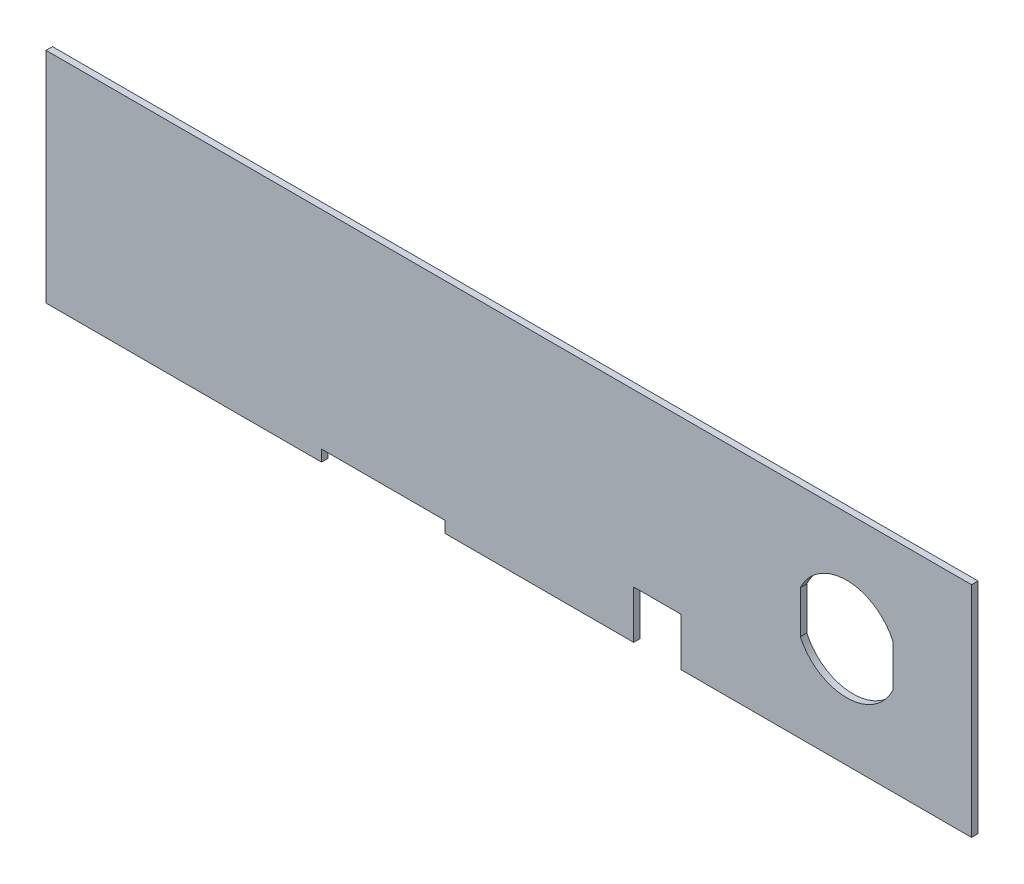
ISO-10303-21;
HEADER;
FILE_DESCRIPTION(('STEP AP214'),'2;1');
FILE_NAME('part.step','',(''),(''),'','','');
FILE_SCHEMA(('AUTOMOTIVE_DESIGN { 1 0 10303 214 1 1 1 1 }'));
ENDSEC;
DATA;
#1=APPLICATION_CONTEXT('core data for automotive mechanical design processes');
#2=APPLICATION_PROTOCOL_DEFINITION('international standard','automotive_design',2000,#1);
#3=PRODUCT_CONTEXT('',#1,'mechanical');
#4=PRODUCT('Part','Part','',(#3));
#5=PRODUCT_RELATED_PRODUCT_CATEGORY('part','',(#4));
#6=PRODUCT_DEFINITION_FORMATION('','',#4);
#7=PRODUCT_DEFINITION_CONTEXT('part definition',#1,'design');
#8=PRODUCT_DEFINITION('design','',#6,#7);
#9=PRODUCT_DEFINITION_SHAPE('','',#8);
#10=(LENGTH_UNIT() NAMED_UNIT(*) SI_UNIT(.MILLI.,.METRE.));
#11=(NAMED_UNIT(*) PLANE_ANGLE_UNIT() SI_UNIT($,.RADIAN.));
#12=(NAMED_UNIT(*) SI_UNIT($,.STERADIAN.) SOLID_ANGLE_UNIT());
#13=UNCERTAINTY_MEASURE_WITH_UNIT(LENGTH_MEASURE(1.E-05),#10,'distance_accuracy_value','');
#14=(GEOMETRIC_REPRESENTATION_CONTEXT(3) GLOBAL_UNCERTAINTY_ASSIGNED_CONTEXT((#13)) GLOBAL_UNIT_ASSIGNED_CONTEXT((#10,
#11,#12)) REPRESENTATION_CONTEXT('',''));
#15=CARTESIAN_POINT('',(0.,0.,0.));
#16=DIRECTION('',(0.,0.,1.));
#17=DIRECTION('',(1.,0.,0.));
#18=AXIS2_PLACEMENT_3D('',#15,#16,#17);
#19=CARTESIAN_POINT('',(0.,3.11149999999998,1.778));
#20=DIRECTION('',(0.,1.,0.));
#21=DIRECTION('',(-1.,0.,0.));
#22=AXIS2_PLACEMENT_3D('',#19,#20,#21);
#23=PLANE('',#22);
#24=DIRECTION('',(1.,0.,0.));
#25=VECTOR('',#24,1.);
#26=CARTESIAN_POINT('',(0.,3.11149999999998,0.));
#27=LINE('',#26,#25);
#28=CARTESIAN_POINT('',(75.6158,3.1115,0.));
#29=VERTEX_POINT('',#28);
#30=CARTESIAN_POINT('',(109.4486,3.11150000000001,0.));
#31=VERTEX_POINT('',#30);
#32=EDGE_CURVE('E261',#29,#31,#27,.T.);
#33=ORIENTED_EDGE('',*,*,#32,.T.);
#34=DIRECTION('',(0.,0.,-1.));
#35=VECTOR('',#34,1.);
#36=CARTESIAN_POINT('',(109.4486,3.11150000000001,1.778));
#37=LINE('',#36,#35);
#38=CARTESIAN_POINT('',(109.4486,3.11150000000001,1.778));
#39=VERTEX_POINT('',#38);
#40=EDGE_CURVE('E11',#39,#31,#37,.T.);
#41=ORIENTED_EDGE('',*,*,#40,.F.);
#42=DIRECTION('',(1.,0.,0.));
#43=VECTOR('',#42,1.);
#44=CARTESIAN_POINT('',(0.,3.11149999999998,1.778));
#45=LINE('',#44,#43);
#46=CARTESIAN_POINT('',(75.6158,3.1115,1.778));
#47=VERTEX_POINT('',#46);
#48=EDGE_CURVE('E191',#47,#39,#45,.T.);
#49=ORIENTED_EDGE('',*,*,#48,.F.);
#50=DIRECTION('',(0.,0.,-1.));
#51=VECTOR('',#50,1.);
#52=CARTESIAN_POINT('',(75.6158,3.1115,1.778));
#53=LINE('',#52,#51);
#54=EDGE_CURVE('E51',#47,#29,#53,.T.);
#55=ORIENTED_EDGE('',*,*,#54,.T.);
#56=EDGE_LOOP('',(#33,#41,#49,#55));
#57=FACE_BOUND('',#56,.T.);
#58=ADVANCED_FACE('F32',(#57),#23,.F.);
#59=CARTESIAN_POINT('',(109.4486,0.,1.778));
#60=DIRECTION('',(1.,0.,0.));
#61=DIRECTION('',(0.,0.,-1.));
#62=AXIS2_PLACEMENT_3D('',#59,#60,#61);
#63=PLANE('',#62);
#64=DIRECTION('',(0.,-1.,0.));
#65=VECTOR('',#64,1.);
#66=CARTESIAN_POINT('',(109.4486,0.,0.));
#67=LINE('',#66,#65);
#68=CARTESIAN_POINT('',(109.4486,0.,0.));
#69=VERTEX_POINT('',#68);
#70=EDGE_CURVE('E263',#31,#69,#67,.T.);
#71=ORIENTED_EDGE('',*,*,#70,.T.);
#72=DIRECTION('',(0.,0.,-1.));
#73=VECTOR('',#72,1.);
#74=CARTESIAN_POINT('',(109.4486,0.,1.778));
#75=LINE('',#74,#73);
#76=CARTESIAN_POINT('',(109.4486,0.,1.778));
#77=VERTEX_POINT('',#76);
#78=EDGE_CURVE('E42',#77,#69,#75,.T.);
#79=ORIENTED_EDGE('',*,*,#78,.F.);
#80=DIRECTION('',(0.,-1.,0.));
#81=VECTOR('',#80,1.);
#82=CARTESIAN_POINT('',(109.4486,0.,1.778));
#83=LINE('',#82,#81);
#84=EDGE_CURVE('E187',#39,#77,#83,.T.);
#85=ORIENTED_EDGE('',*,*,#84,.F.);
#86=ORIENTED_EDGE('',*,*,#40,.T.);
#87=EDGE_LOOP('',(#71,#79,#85,#86));
#88=FACE_BOUND('',#87,.T.);
#89=ADVANCED_FACE('F309',(#88),#63,.F.);
#90=CARTESIAN_POINT('',(0.,0.,1.778));
#91=DIRECTION('',(0.,1.,0.));
#92=DIRECTION('',(0.,0.,1.));
#93=AXIS2_PLACEMENT_3D('',#90,#91,#92);
#94=PLANE('',#93);
#95=DIRECTION('',(1.,0.,0.));
#96=VECTOR('',#95,1.);
#97=CARTESIAN_POINT('',(0.,0.,0.));
#98=LINE('',#97,#96);
#99=CARTESIAN_POINT('',(161.29,0.,0.));
#100=VERTEX_POINT('',#99);
#101=EDGE_CURVE('E213',#69,#100,#98,.T.);
#102=ORIENTED_EDGE('',*,*,#101,.T.);
#103=DIRECTION('',(0.,0.,-1.));
#104=VECTOR('',#103,1.);
#105=CARTESIAN_POINT('',(161.29,0.,1.778));
#106=LINE('',#105,#104);
#107=CARTESIAN_POINT('',(161.29,0.,1.778));
#108=VERTEX_POINT('',#107);
#109=EDGE_CURVE('E231',#108,#100,#106,.T.);
#110=ORIENTED_EDGE('',*,*,#109,.F.);
#111=DIRECTION('',(1.,0.,0.));
#112=VECTOR('',#111,1.);
#113=CARTESIAN_POINT('',(0.,0.,1.778));
#114=LINE('',#113,#112);
#115=EDGE_CURVE('E179',#77,#108,#114,.T.);
#116=ORIENTED_EDGE('',*,*,#115,.F.);
#117=ORIENTED_EDGE('',*,*,#78,.T.);
#118=EDGE_LOOP('',(#102,#110,#116,#117));
#119=FACE_BOUND('',#118,.T.);
#120=ADVANCED_FACE('F307',(#119),#94,.F.);
#121=CARTESIAN_POINT('',(161.29,0.,1.778));
#122=DIRECTION('',(-1.,0.,0.));
#123=DIRECTION('',(0.,0.,1.));
#124=AXIS2_PLACEMENT_3D('',#121,#122,#123);
#125=PLANE('',#124);
#126=DIRECTION('',(0.,1.,0.));
#127=VECTOR('',#126,1.);
#128=CARTESIAN_POINT('',(161.29,0.,0.));
#129=LINE('',#128,#127);
#130=CARTESIAN_POINT('',(161.29,13.1699,0.));
#131=VERTEX_POINT('',#130);
#132=EDGE_CURVE('E265',#100,#131,#129,.T.);
#133=ORIENTED_EDGE('',*,*,#132,.T.);
#134=DIRECTION('',(0.,0.,-1.));
#135=VECTOR('',#134,1.);
#136=CARTESIAN_POINT('',(161.29,13.1699,1.778));
#137=LINE('',#136,#135);
#138=CARTESIAN_POINT('',(161.29,13.1699,1.778));
#139=VERTEX_POINT('',#138);
#140=EDGE_CURVE('E228',#139,#131,#137,.T.);
#141=ORIENTED_EDGE('',*,*,#140,.F.);
#142=DIRECTION('',(0.,1.,0.));
#143=VECTOR('',#142,1.);
#144=CARTESIAN_POINT('',(161.29,0.,1.778));
#145=LINE('',#144,#143);
#146=EDGE_CURVE('E186',#108,#139,#145,.T.);
#147=ORIENTED_EDGE('',*,*,#146,.F.);
#148=ORIENTED_EDGE('',*,*,#109,.T.);
#149=EDGE_LOOP('',(#133,#141,#147,#148));
#150=FACE_BOUND('',#149,.T.);
#151=ADVANCED_FACE('F304',(#150),#125,.F.);
#152=CARTESIAN_POINT('',(0.,13.1699,1.778));
#153=DIRECTION('',(0.,1.,0.));
#154=DIRECTION('',(0.,0.,1.));
#155=AXIS2_PLACEMENT_3D('',#152,#153,#154);
#156=PLANE('',#155);
#157=DIRECTION('',(1.,0.,0.));
#158=VECTOR('',#157,1.);
#159=CARTESIAN_POINT('',(0.,13.1699,0.));
#160=LINE('',#159,#158);
#161=CARTESIAN_POINT('',(174.3202,13.1699,0.));
#162=VERTEX_POINT('',#161);
#163=EDGE_CURVE('E267',#131,#162,#160,.T.);
#164=ORIENTED_EDGE('',*,*,#163,.T.);
#165=DIRECTION('',(0.,0.,-1.));
#166=VECTOR('',#165,1.);
#167=CARTESIAN_POINT('',(174.3202,13.1699,1.778));
#168=LINE('',#167,#166);
#169=CARTESIAN_POINT('',(174.3202,13.1699,1.778));
#170=VERTEX_POINT('',#169);
#171=EDGE_CURVE('E226',#170,#162,#168,.T.);
#172=ORIENTED_EDGE('',*,*,#171,.F.);
#173=DIRECTION('',(1.,0.,0.));
#174=VECTOR('',#173,1.);
#175=CARTESIAN_POINT('',(0.,13.1699,1.778));
#176=LINE('',#175,#174);
#177=EDGE_CURVE('E190',#139,#170,#176,.T.);
#178=ORIENTED_EDGE('',*,*,#177,.F.);
#179=ORIENTED_EDGE('',*,*,#140,.T.);
#180=EDGE_LOOP('',(#164,#172,#178,#179));
#181=FACE_BOUND('',#180,.T.);
#182=ADVANCED_FACE('F299',(#181),#156,.F.);
#183=CARTESIAN_POINT('',(174.3202,0.,1.778));
#184=DIRECTION('',(-1.,0.,0.));
#185=DIRECTION('',(0.,0.,1.));
#186=AXIS2_PLACEMENT_3D('',#183,#184,#185);
#187=PLANE('',#186);
#188=DIRECTION('',(0.,1.,0.));
#189=VECTOR('',#188,1.);
#190=CARTESIAN_POINT('',(174.3202,0.,0.));
#191=LINE('',#190,#189);
#192=CARTESIAN_POINT('',(174.3202,0.,0.));
#193=VERTEX_POINT('',#192);
#194=EDGE_CURVE('E270',#193,#162,#191,.T.);
#195=ORIENTED_EDGE('',*,*,#194,.F.);
#196=DIRECTION('',(0.,0.,-1.));
#197=VECTOR('',#196,1.);
#198=CARTESIAN_POINT('',(174.3202,0.,1.778));
#199=LINE('',#198,#197);
#200=CARTESIAN_POINT('',(174.3202,0.,1.778));
#201=VERTEX_POINT('',#200);
#202=EDGE_CURVE('E224',#201,#193,#199,.T.);
#203=ORIENTED_EDGE('',*,*,#202,.F.);
#204=DIRECTION('',(0.,1.,0.));
#205=VECTOR('',#204,1.);
#206=CARTESIAN_POINT('',(174.3202,0.,1.778));
#207=LINE('',#206,#205);
#208=EDGE_CURVE('E185',#201,#170,#207,.T.);
#209=ORIENTED_EDGE('',*,*,#208,.T.);
#210=ORIENTED_EDGE('',*,*,#171,.T.);
#211=EDGE_LOOP('',(#195,#203,#209,#210));
#212=FACE_BOUND('',#211,.T.);
#213=ADVANCED_FACE('F293',(#212),#187,.T.);
#214=CARTESIAN_POINT('',(254.,0.,0.));
#215=VERTEX_POINT('',#214);
#216=EDGE_CURVE('E212',#193,#215,#98,.T.);
#217=ORIENTED_EDGE('',*,*,#216,.T.);
#218=DIRECTION('',(0.,0.,-1.));
#219=VECTOR('',#218,1.);
#220=CARTESIAN_POINT('',(254.,0.,1.778));
#221=LINE('',#220,#219);
#222=CARTESIAN_POINT('',(254.,0.,1.778));
#223=VERTEX_POINT('',#222);
#224=EDGE_CURVE('E222',#223,#215,#221,.T.);
#225=ORIENTED_EDGE('',*,*,#224,.F.);
#226=EDGE_CURVE('E178',#201,#223,#114,.T.);
#227=ORIENTED_EDGE('',*,*,#226,.F.);
#228=ORIENTED_EDGE('',*,*,#202,.T.);
#229=EDGE_LOOP('',(#217,#225,#227,#228));
#230=FACE_BOUND('',#229,.T.);
#231=ADVANCED_FACE('F289',(#230),#94,.F.);
#232=CARTESIAN_POINT('',(254.,0.,1.778));
#233=DIRECTION('',(1.,0.,0.));
#234=DIRECTION('',(0.,0.,-1.));
#235=AXIS2_PLACEMENT_3D('',#232,#233,#234);
#236=PLANE('',#235);
#237=DIRECTION('',(0.,-1.,0.));
#238=VECTOR('',#237,1.);
#239=CARTESIAN_POINT('',(254.,0.,0.));
#240=LINE('',#239,#238);
#241=CARTESIAN_POINT('',(254.,60.071,0.));
#242=VERTEX_POINT('',#241);
#243=EDGE_CURVE('E273',#242,#215,#240,.T.);
#244=ORIENTED_EDGE('',*,*,#243,.F.);
#245=DIRECTION('',(0.,0.,-1.));
#246=VECTOR('',#245,1.);
#247=CARTESIAN_POINT('',(254.,60.071,1.778));
#248=LINE('',#247,#246);
#249=CARTESIAN_POINT('',(254.,60.071,1.778));
#250=VERTEX_POINT('',#249);
#251=EDGE_CURVE('E220',#250,#242,#248,.T.);
#252=ORIENTED_EDGE('',*,*,#251,.F.);
#253=DIRECTION('',(0.,-1.,0.));
#254=VECTOR('',#253,1.);
#255=CARTESIAN_POINT('',(254.,0.,1.778));
#256=LINE('',#255,#254);
#257=EDGE_CURVE('E184',#250,#223,#256,.T.);
#258=ORIENTED_EDGE('',*,*,#257,.T.);
#259=ORIENTED_EDGE('',*,*,#224,.T.);
#260=EDGE_LOOP('',(#244,#252,#258,#259));
#261=FACE_BOUND('',#260,.T.);
#262=ADVANCED_FACE('F284',(#261),#236,.T.);
#263=CARTESIAN_POINT('',(0.,60.071,1.778));
#264=DIRECTION('',(0.,1.,0.));
#265=DIRECTION('',(0.,0.,1.));
#266=AXIS2_PLACEMENT_3D('',#263,#264,#265);
#267=PLANE('',#266);
#268=DIRECTION('',(1.,0.,0.));
#269=VECTOR('',#268,1.);
#270=CARTESIAN_POINT('',(0.,60.071,0.));
#271=LINE('',#270,#269);
#272=CARTESIAN_POINT('',(0.,60.071,0.));
#273=VERTEX_POINT('',#272);
#274=EDGE_CURVE('E275',#273,#242,#271,.T.);
#275=ORIENTED_EDGE('',*,*,#274,.F.);
#276=DIRECTION('',(0.,0.,-1.));
#277=VECTOR('',#276,1.);
#278=CARTESIAN_POINT('',(0.,60.071,1.778));
#279=LINE('',#278,#277);
#280=CARTESIAN_POINT('',(0.,60.071,1.778));
#281=VERTEX_POINT('',#280);
#282=EDGE_CURVE('E173',#281,#273,#279,.T.);
#283=ORIENTED_EDGE('',*,*,#282,.F.);
#284=DIRECTION('',(1.,0.,0.));
#285=VECTOR('',#284,1.);
#286=CARTESIAN_POINT('',(0.,60.071,1.778));
#287=LINE('',#286,#285);
#288=EDGE_CURVE('E163',#281,#250,#287,.T.);
#289=ORIENTED_EDGE('',*,*,#288,.T.);
#290=ORIENTED_EDGE('',*,*,#251,.T.);
#291=EDGE_LOOP('',(#275,#283,#289,#290));
#292=FACE_BOUND('',#291,.T.);
#293=ADVANCED_FACE('F281',(#292),#267,.T.);
#294=CARTESIAN_POINT('',(0.,0.,1.778));
#295=DIRECTION('',(1.,0.,0.));
#296=DIRECTION('',(0.,0.,-1.));
#297=AXIS2_PLACEMENT_3D('',#294,#295,#296);
#298=PLANE('',#297);
#299=DIRECTION('',(0.,-1.,0.));
#300=VECTOR('',#299,1.);
#301=CARTESIAN_POINT('',(0.,0.,0.));
#302=LINE('',#301,#300);
#303=CARTESIAN_POINT('',(0.,0.,0.));
#304=VERTEX_POINT('',#303);
#305=EDGE_CURVE('E170',#273,#304,#302,.T.);
#306=ORIENTED_EDGE('',*,*,#305,.T.);
#307=DIRECTION('',(0.,0.,-1.));
#308=VECTOR('',#307,1.);
#309=CARTESIAN_POINT('',(0.,0.,1.778));
#310=LINE('',#309,#308);
#311=CARTESIAN_POINT('',(0.,0.,1.778));
#312=VERTEX_POINT('',#311);
#313=EDGE_CURVE('E167',#312,#304,#310,.T.);
#314=ORIENTED_EDGE('',*,*,#313,.F.);
#315=DIRECTION('',(0.,-1.,0.));
#316=VECTOR('',#315,1.);
#317=CARTESIAN_POINT('',(0.,0.,1.778));
#318=LINE('',#317,#316);
#319=EDGE_CURVE('E154',#281,#312,#318,.T.);
#320=ORIENTED_EDGE('',*,*,#319,.F.);
#321=ORIENTED_EDGE('',*,*,#282,.T.);
#322=EDGE_LOOP('',(#306,#314,#320,#321));
#323=FACE_BOUND('',#322,.T.);
#324=ADVANCED_FACE('F168',(#323),#298,.F.);
#325=CARTESIAN_POINT('',(75.6158,0.,0.));
#326=VERTEX_POINT('',#325);
#327=EDGE_CURVE('E208',#304,#326,#98,.T.);
#328=ORIENTED_EDGE('',*,*,#327,.T.);
#329=DIRECTION('',(0.,0.,-1.));
#330=VECTOR('',#329,1.);
#331=CARTESIAN_POINT('',(75.6158,0.,1.778));
#332=LINE('',#331,#330);
#333=CARTESIAN_POINT('',(75.6158,0.,1.778));
#334=VERTEX_POINT('',#333);
#335=EDGE_CURVE('E102',#334,#326,#332,.T.);
#336=ORIENTED_EDGE('',*,*,#335,.F.);
#337=EDGE_CURVE('E160',#312,#334,#114,.T.);
#338=ORIENTED_EDGE('',*,*,#337,.F.);
#339=ORIENTED_EDGE('',*,*,#313,.T.);
#340=EDGE_LOOP('',(#328,#336,#338,#339));
#341=FACE_BOUND('',#340,.T.);
#342=ADVANCED_FACE('F175',(#341),#94,.F.);
#343=CARTESIAN_POINT('',(219.71,30.0355,1.778));
#344=DIRECTION('',(0.,0.,-1.));
#345=DIRECTION('',(-1.,0.,0.));
#346=AXIS2_PLACEMENT_3D('',#343,#344,#345);
#347=CYLINDRICAL_SURFACE('',#346,13.97);
#348=CARTESIAN_POINT('',(219.71,30.0355,0.));
#349=DIRECTION('',(0.,0.,1.));
#350=DIRECTION('',(1.,0.,0.));
#351=AXIS2_PLACEMENT_3D('',#348,#349,#350);
#352=CIRCLE('',#351,13.97);
#353=CARTESIAN_POINT('',(207.01,24.2156288674061,0.));
#354=VERTEX_POINT('',#353);
#355=CARTESIAN_POINT('',(232.41,24.2156288674061,0.));
#356=VERTEX_POINT('',#355);
#357=EDGE_CURVE('E252',#354,#356,#352,.T.);
#358=ORIENTED_EDGE('',*,*,#357,.F.);
#359=DIRECTION('',(0.,0.,-1.));
#360=VECTOR('',#359,1.);
#361=CARTESIAN_POINT('',(207.01,24.2156288674061,1.778));
#362=LINE('',#361,#360);
#363=CARTESIAN_POINT('',(207.01,24.2156288674061,1.778));
#364=VERTEX_POINT('',#363);
#365=EDGE_CURVE('E36',#364,#354,#362,.T.);
#366=ORIENTED_EDGE('',*,*,#365,.F.);
#367=CARTESIAN_POINT('',(219.71,30.0355,1.778));
#368=DIRECTION('',(0.,0.,1.));
#369=DIRECTION('',(1.,0.,0.));
#370=AXIS2_PLACEMENT_3D('',#367,#368,#369);
#371=CIRCLE('',#370,13.97);
#372=CARTESIAN_POINT('',(232.41,24.2156288674061,1.778));
#373=VERTEX_POINT('',#372);
#374=EDGE_CURVE('E203',#364,#373,#371,.T.);
#375=ORIENTED_EDGE('',*,*,#374,.T.);
#376=DIRECTION('',(0.,0.,-1.));
#377=VECTOR('',#376,1.);
#378=CARTESIAN_POINT('',(232.41,24.2156288674061,1.778));
#379=LINE('',#378,#377);
#380=EDGE_CURVE('E180',#373,#356,#379,.T.);
#381=ORIENTED_EDGE('',*,*,#380,.T.);
#382=EDGE_LOOP('',(#358,#366,#375,#381));
#383=FACE_BOUND('',#382,.T.);
#384=ADVANCED_FACE('F34',(#383),#347,.F.);
#385=CARTESIAN_POINT('',(207.01,0.,1.778));
#386=DIRECTION('',(-1.,0.,0.));
#387=DIRECTION('',(0.,0.,1.));
#388=AXIS2_PLACEMENT_3D('',#385,#386,#387);
#389=PLANE('',#388);
#390=DIRECTION('',(0.,1.,0.));
#391=VECTOR('',#390,1.);
#392=CARTESIAN_POINT('',(207.01,0.,0.));
#393=LINE('',#392,#391);
#394=CARTESIAN_POINT('',(207.01,35.8553711325939,0.));
#395=VERTEX_POINT('',#394);
#396=EDGE_CURVE('E246',#354,#395,#393,.T.);
#397=ORIENTED_EDGE('',*,*,#396,.T.);
#398=DIRECTION('',(0.,0.,-1.));
#399=VECTOR('',#398,1.);
#400=CARTESIAN_POINT('',(207.01,35.8553711325939,1.778));
#401=LINE('',#400,#399);
#402=CARTESIAN_POINT('',(207.01,35.8553711325939,1.778));
#403=VERTEX_POINT('',#402);
#404=EDGE_CURVE('E238',#403,#395,#401,.T.);
#405=ORIENTED_EDGE('',*,*,#404,.F.);
#406=DIRECTION('',(0.,1.,0.));
#407=VECTOR('',#406,1.);
#408=CARTESIAN_POINT('',(207.01,0.,1.778));
#409=LINE('',#408,#407);
#410=EDGE_CURVE('E201',#364,#403,#409,.T.);
#411=ORIENTED_EDGE('',*,*,#410,.F.);
#412=ORIENTED_EDGE('',*,*,#365,.T.);
#413=EDGE_LOOP('',(#397,#405,#411,#412));
#414=FACE_BOUND('',#413,.T.);
#415=ADVANCED_FACE('F245',(#414),#389,.F.);
#416=CARTESIAN_POINT('',(219.71,30.0355,1.778));
#417=DIRECTION('',(0.,0.,-1.));
#418=DIRECTION('',(-1.,0.,0.));
#419=AXIS2_PLACEMENT_3D('',#416,#417,#418);
#420=CYLINDRICAL_SURFACE('',#419,13.97);
#421=CARTESIAN_POINT('',(219.71,30.0355,0.));
#422=DIRECTION('',(0.,0.,1.));
#423=DIRECTION('',(1.,0.,0.));
#424=AXIS2_PLACEMENT_3D('',#421,#422,#423);
#425=CIRCLE('',#424,13.97);
#426=CARTESIAN_POINT('',(232.41,35.8553711325939,0.));
#427=VERTEX_POINT('',#426);
#428=EDGE_CURVE('E254',#427,#395,#425,.T.);
#429=ORIENTED_EDGE('',*,*,#428,.F.);
#430=DIRECTION('',(0.,0.,-1.));
#431=VECTOR('',#430,1.);
#432=CARTESIAN_POINT('',(232.41,35.8553711325939,1.778));
#433=LINE('',#432,#431);
#434=CARTESIAN_POINT('',(232.41,35.8553711325939,1.778));
#435=VERTEX_POINT('',#434);
#436=EDGE_CURVE('E237',#435,#427,#433,.T.);
#437=ORIENTED_EDGE('',*,*,#436,.F.);
#438=CARTESIAN_POINT('',(219.71,30.0355,1.778));
#439=DIRECTION('',(0.,0.,1.));
#440=DIRECTION('',(1.,0.,0.));
#441=AXIS2_PLACEMENT_3D('',#438,#439,#440);
#442=CIRCLE('',#441,13.97);
#443=EDGE_CURVE('E198',#435,#403,#442,.T.);
#444=ORIENTED_EDGE('',*,*,#443,.T.);
#445=ORIENTED_EDGE('',*,*,#404,.T.);
#446=EDGE_LOOP('',(#429,#437,#444,#445));
#447=FACE_BOUND('',#446,.T.);
#448=ADVANCED_FACE('F321',(#447),#420,.F.);
#449=CARTESIAN_POINT('',(232.41,0.,1.778));
#450=DIRECTION('',(-1.,0.,0.));
#451=DIRECTION('',(0.,0.,1.));
#452=AXIS2_PLACEMENT_3D('',#449,#450,#451);
#453=PLANE('',#452);
#454=DIRECTION('',(0.,1.,0.));
#455=VECTOR('',#454,1.);
#456=CARTESIAN_POINT('',(232.41,0.,0.));
#457=LINE('',#456,#455);
#458=EDGE_CURVE('E259',#356,#427,#457,.T.);
#459=ORIENTED_EDGE('',*,*,#458,.F.);
#460=ORIENTED_EDGE('',*,*,#380,.F.);
#461=DIRECTION('',(0.,1.,0.));
#462=VECTOR('',#461,1.);
#463=CARTESIAN_POINT('',(232.41,0.,1.778));
#464=LINE('',#463,#462);
#465=EDGE_CURVE('E193',#373,#435,#464,.T.);
#466=ORIENTED_EDGE('',*,*,#465,.T.);
#467=ORIENTED_EDGE('',*,*,#436,.T.);
#468=EDGE_LOOP('',(#459,#460,#466,#467));
#469=FACE_BOUND('',#468,.T.);
#470=ADVANCED_FACE('F313',(#469),#453,.T.);
#471=CARTESIAN_POINT('',(75.6158,0.,1.778));
#472=DIRECTION('',(1.,0.,0.));
#473=DIRECTION('',(0.,0.,-1.));
#474=AXIS2_PLACEMENT_3D('',#471,#472,#473);
#475=PLANE('',#474);
#476=DIRECTION('',(0.,-1.,0.));
#477=VECTOR('',#476,1.);
#478=CARTESIAN_POINT('',(75.6158,0.,0.));
#479=LINE('',#478,#477);
#480=EDGE_CURVE('E204',#29,#326,#479,.T.);
#481=ORIENTED_EDGE('',*,*,#480,.F.);
#482=ORIENTED_EDGE('',*,*,#54,.F.);
#483=DIRECTION('',(0.,-1.,0.));
#484=VECTOR('',#483,1.);
#485=CARTESIAN_POINT('',(75.6158,0.,1.778));
#486=LINE('',#485,#484);
#487=EDGE_CURVE('E176',#47,#334,#486,.T.);
#488=ORIENTED_EDGE('',*,*,#487,.T.);
#489=ORIENTED_EDGE('',*,*,#335,.T.);
#490=EDGE_LOOP('',(#481,#482,#488,#489));
#491=FACE_BOUND('',#490,.T.);
#492=ADVANCED_FACE('F311',(#491),#475,.T.);
#493=CARTESIAN_POINT('',(0.,0.,1.778));
#494=DIRECTION('',(0.,0.,1.));
#495=DIRECTION('',(1.,0.,0.));
#496=AXIS2_PLACEMENT_3D('',#493,#494,#495);
#497=PLANE('',#496);
#498=ORIENTED_EDGE('',*,*,#374,.F.);
#499=ORIENTED_EDGE('',*,*,#410,.T.);
#500=ORIENTED_EDGE('',*,*,#443,.F.);
#501=ORIENTED_EDGE('',*,*,#465,.F.);
#502=EDGE_LOOP('',(#498,#499,#500,#501));
#503=FACE_BOUND('',#502,.T.);
#504=ORIENTED_EDGE('',*,*,#48,.T.);
#505=ORIENTED_EDGE('',*,*,#84,.T.);
#506=ORIENTED_EDGE('',*,*,#115,.T.);
#507=ORIENTED_EDGE('',*,*,#146,.T.);
#508=ORIENTED_EDGE('',*,*,#177,.T.);
#509=ORIENTED_EDGE('',*,*,#208,.F.);
#510=ORIENTED_EDGE('',*,*,#226,.T.);
#511=ORIENTED_EDGE('',*,*,#257,.F.);
#512=ORIENTED_EDGE('',*,*,#288,.F.);
#513=ORIENTED_EDGE('',*,*,#319,.T.);
#514=ORIENTED_EDGE('',*,*,#337,.T.);
#515=ORIENTED_EDGE('',*,*,#487,.F.);
#516=EDGE_LOOP('',(#504,#505,#506,#507,#508,#509,#510,#511,#512,#513,#514,#515));
#517=FACE_BOUND('',#516,.T.);
#518=ADVANCED_FACE('F157',(#503,#517),#497,.T.);
#519=CARTESIAN_POINT('',(0.,0.,0.));
#520=DIRECTION('',(0.,0.,1.));
#521=DIRECTION('',(1.,0.,0.));
#522=AXIS2_PLACEMENT_3D('',#519,#520,#521);
#523=PLANE('',#522);
#524=ORIENTED_EDGE('',*,*,#357,.T.);
#525=ORIENTED_EDGE('',*,*,#458,.T.);
#526=ORIENTED_EDGE('',*,*,#428,.T.);
#527=ORIENTED_EDGE('',*,*,#396,.F.);
#528=EDGE_LOOP('',(#524,#525,#526,#527));
#529=FACE_BOUND('',#528,.T.);
#530=ORIENTED_EDGE('',*,*,#32,.F.);
#531=ORIENTED_EDGE('',*,*,#480,.T.);
#532=ORIENTED_EDGE('',*,*,#327,.F.);
#533=ORIENTED_EDGE('',*,*,#305,.F.);
#534=ORIENTED_EDGE('',*,*,#274,.T.);
#535=ORIENTED_EDGE('',*,*,#243,.T.);
#536=ORIENTED_EDGE('',*,*,#216,.F.);
#537=ORIENTED_EDGE('',*,*,#194,.T.);
#538=ORIENTED_EDGE('',*,*,#163,.F.);
#539=ORIENTED_EDGE('',*,*,#132,.F.);
#540=ORIENTED_EDGE('',*,*,#101,.F.);
#541=ORIENTED_EDGE('',*,*,#70,.F.);
#542=EDGE_LOOP('',(#530,#531,#532,#533,#534,#535,#536,#537,#538,#539,#540,#541));
#543=FACE_BOUND('',#542,.T.);
#544=ADVANCED_FACE('F250',(#529,#543),#523,.F.);
#545=CLOSED_SHELL('',(#58,#89,#120,#151,#182,#213,#231,#262,#293,#324,#342,#384,#415,#448,#470,
#492,#518,#544));
#546=MANIFOLD_SOLID_BREP('B2',#545);
#547=ADVANCED_BREP_SHAPE_REPRESENTATION('',(#18,#546),#14);
#548=SHAPE_DEFINITION_REPRESENTATION(#9,#547);
ENDSEC;
END-ISO-10303-21;
